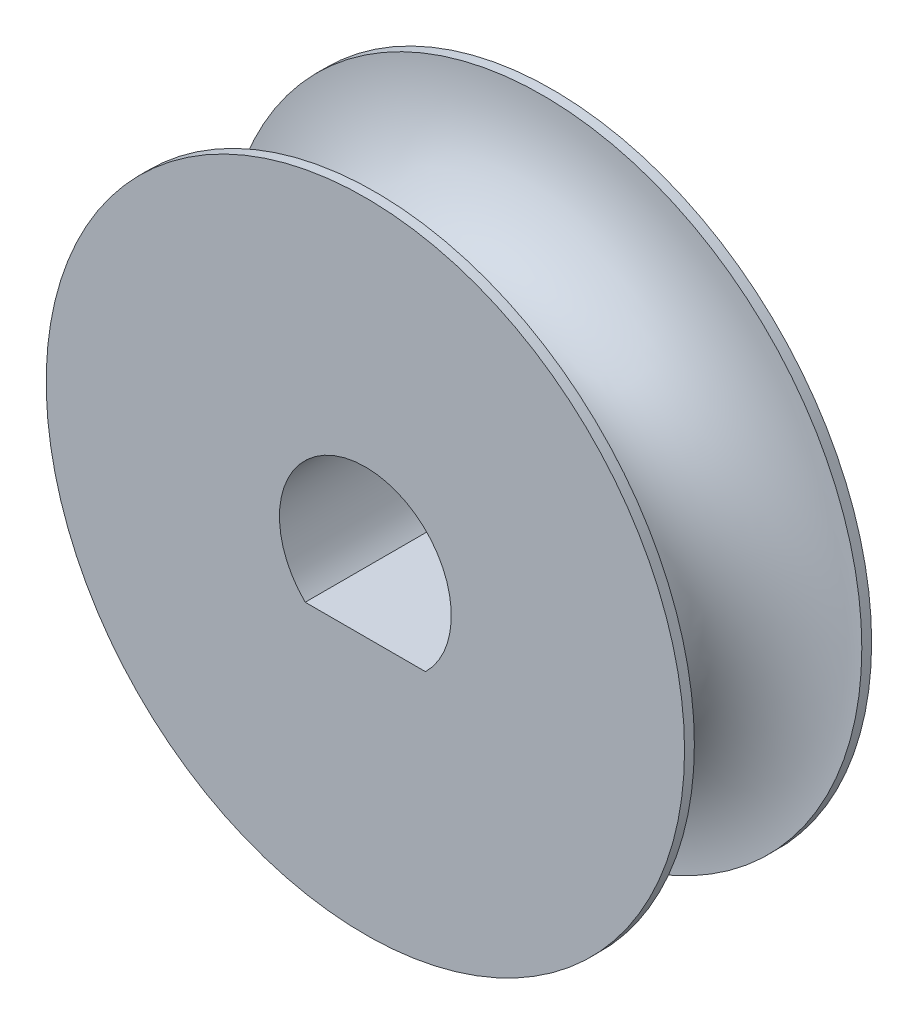
ISO-10303-21;
HEADER;
FILE_DESCRIPTION(('STEP AP214'),'2;1');
FILE_NAME('part.step','',(''),(''),'','','');
FILE_SCHEMA(('AUTOMOTIVE_DESIGN { 1 0 10303 214 1 1 1 1 }'));
ENDSEC;
DATA;
#1=APPLICATION_CONTEXT('core data for automotive mechanical design processes');
#2=APPLICATION_PROTOCOL_DEFINITION('international standard','automotive_design',2000,#1);
#3=PRODUCT_CONTEXT('',#1,'mechanical');
#4=PRODUCT('Part','Part','',(#3));
#5=PRODUCT_RELATED_PRODUCT_CATEGORY('part','',(#4));
#6=PRODUCT_DEFINITION_FORMATION('','',#4);
#7=PRODUCT_DEFINITION_CONTEXT('part definition',#1,'design');
#8=PRODUCT_DEFINITION('design','',#6,#7);
#9=PRODUCT_DEFINITION_SHAPE('','',#8);
#10=(LENGTH_UNIT() NAMED_UNIT(*) SI_UNIT(.MILLI.,.METRE.));
#11=(NAMED_UNIT(*) PLANE_ANGLE_UNIT() SI_UNIT($,.RADIAN.));
#12=(NAMED_UNIT(*) SI_UNIT($,.STERADIAN.) SOLID_ANGLE_UNIT());
#13=UNCERTAINTY_MEASURE_WITH_UNIT(LENGTH_MEASURE(1.E-05),#10,'distance_accuracy_value','');
#14=(GEOMETRIC_REPRESENTATION_CONTEXT(3) GLOBAL_UNCERTAINTY_ASSIGNED_CONTEXT((#13)) GLOBAL_UNIT_ASSIGNED_CONTEXT((#10,
#11,#12)) REPRESENTATION_CONTEXT('',''));
#15=CARTESIAN_POINT('',(0.,0.,0.));
#16=DIRECTION('',(0.,0.,1.));
#17=DIRECTION('',(1.,0.,0.));
#18=AXIS2_PLACEMENT_3D('',#15,#16,#17);
#19=CARTESIAN_POINT('',(-25.2757738629294,2.90747906476861,-5.81));
#20=DIRECTION('',(0.,0.,1.));
#21=DIRECTION('',(1.,0.,0.));
#22=AXIS2_PLACEMENT_3D('',#19,#20,#21);
#23=CYLINDRICAL_SURFACE('',#22,6.5);
#24=CARTESIAN_POINT('',(-25.2757738629294,2.90747906476861,-5.61));
#25=DIRECTION('',(0.,0.,1.));
#26=DIRECTION('',(1.,0.,0.));
#27=AXIS2_PLACEMENT_3D('',#24,#25,#26);
#28=CIRCLE('',#27,6.5);
#29=CARTESIAN_POINT('',(-18.7757738629294,2.90747906476861,-5.61));
#30=VERTEX_POINT('',#29);
#31=EDGE_CURVE('E39',#30,#30,#28,.T.);
#32=ORIENTED_EDGE('',*,*,#31,.F.);
#33=EDGE_LOOP('',(#32));
#34=FACE_BOUND('',#33,.T.);
#35=CARTESIAN_POINT('',(-25.2757738629294,2.90747906476861,-5.81));
#36=DIRECTION('',(0.,0.,1.));
#37=DIRECTION('',(1.,0.,0.));
#38=AXIS2_PLACEMENT_3D('',#35,#36,#37);
#39=CIRCLE('',#38,6.5);
#40=CARTESIAN_POINT('',(-18.7757738629294,2.90747906476861,-5.81));
#41=VERTEX_POINT('',#40);
#42=EDGE_CURVE('E80',#41,#41,#39,.T.);
#43=ORIENTED_EDGE('',*,*,#42,.T.);
#44=EDGE_LOOP('',(#43));
#45=FACE_BOUND('',#44,.T.);
#46=ADVANCED_FACE('F35',(#34,#45),#23,.T.);
#47=CARTESIAN_POINT('',(-25.2757738629294,2.90747906476861,-5.81));
#48=DIRECTION('',(0.,0.,1.));
#49=DIRECTION('',(1.,0.,0.));
#50=AXIS2_PLACEMENT_3D('',#47,#48,#49);
#51=CYLINDRICAL_SURFACE('',#50,1.75);
#52=CARTESIAN_POINT('',(-25.2757738629294,2.90747906476861,-2.));
#53=DIRECTION('',(0.,0.,1.));
#54=DIRECTION('',(1.,0.,0.));
#55=AXIS2_PLACEMENT_3D('',#52,#53,#54);
#56=CIRCLE('',#55,1.75);
#57=CARTESIAN_POINT('',(-24.0510289915378,1.65747906476861,-2.));
#58=VERTEX_POINT('',#57);
#59=CARTESIAN_POINT('',(-26.500518734321,1.65747906476861,-2.));
#60=VERTEX_POINT('',#59);
#61=EDGE_CURVE('E69',#58,#60,#56,.T.);
#62=ORIENTED_EDGE('',*,*,#61,.T.);
#63=DIRECTION('',(0.,0.,1.));
#64=VECTOR('',#63,1.);
#65=CARTESIAN_POINT('',(-26.500518734321,1.65747906476861,-5.81));
#66=LINE('',#65,#64);
#67=CARTESIAN_POINT('',(-26.500518734321,1.65747906476861,-5.81));
#68=VERTEX_POINT('',#67);
#69=EDGE_CURVE('E11',#68,#60,#66,.T.);
#70=ORIENTED_EDGE('',*,*,#69,.F.);
#71=CARTESIAN_POINT('',(-25.2757738629294,2.90747906476861,-5.81));
#72=DIRECTION('',(0.,0.,1.));
#73=DIRECTION('',(1.,0.,0.));
#74=AXIS2_PLACEMENT_3D('',#71,#72,#73);
#75=CIRCLE('',#74,1.75);
#76=CARTESIAN_POINT('',(-24.0510289915378,1.65747906476861,-5.81));
#77=VERTEX_POINT('',#76);
#78=EDGE_CURVE('E53',#77,#68,#75,.T.);
#79=ORIENTED_EDGE('',*,*,#78,.F.);
#80=DIRECTION('',(0.,0.,1.));
#81=VECTOR('',#80,1.);
#82=CARTESIAN_POINT('',(-24.0510289915378,1.65747906476861,-5.81));
#83=LINE('',#82,#81);
#84=EDGE_CURVE('E45',#77,#58,#83,.T.);
#85=ORIENTED_EDGE('',*,*,#84,.T.);
#86=EDGE_LOOP('',(#62,#70,#79,#85));
#87=FACE_BOUND('',#86,.T.);
#88=ADVANCED_FACE('F37',(#87),#51,.F.);
#89=CARTESIAN_POINT('',(0.,1.65747906476861,-5.81));
#90=DIRECTION('',(0.,1.,0.));
#91=DIRECTION('',(-1.,0.,0.));
#92=AXIS2_PLACEMENT_3D('',#89,#90,#91);
#93=PLANE('',#92);
#94=DIRECTION('',(-1.,0.,0.));
#95=VECTOR('',#94,1.);
#96=CARTESIAN_POINT('',(0.,1.65747906476861,-2.));
#97=LINE('',#96,#95);
#98=EDGE_CURVE('E67',#58,#60,#97,.T.);
#99=ORIENTED_EDGE('',*,*,#98,.F.);
#100=ORIENTED_EDGE('',*,*,#84,.F.);
#101=DIRECTION('',(-1.,0.,0.));
#102=VECTOR('',#101,1.);
#103=CARTESIAN_POINT('',(0.,1.65747906476861,-5.81));
#104=LINE('',#103,#102);
#105=EDGE_CURVE('E68',#77,#68,#104,.T.);
#106=ORIENTED_EDGE('',*,*,#105,.T.);
#107=ORIENTED_EDGE('',*,*,#69,.T.);
#108=EDGE_LOOP('',(#99,#100,#106,#107));
#109=FACE_BOUND('',#108,.T.);
#110=ADVANCED_FACE('F65',(#109),#93,.T.);
#111=CARTESIAN_POINT('',(-25.2757738629294,2.90747906476861,-2.2));
#112=DIRECTION('',(0.,0.,1.));
#113=DIRECTION('',(1.,0.,0.));
#114=AXIS2_PLACEMENT_3D('',#111,#112,#113);
#115=CIRCLE('',#114,6.5);
#116=CARTESIAN_POINT('',(-18.7757738629294,2.90747906476861,-2.2));
#117=VERTEX_POINT('',#116);
#118=EDGE_CURVE('E81',#117,#117,#115,.F.);
#119=ORIENTED_EDGE('',*,*,#118,.F.);
#120=EDGE_LOOP('',(#119));
#121=FACE_BOUND('',#120,.T.);
#122=CARTESIAN_POINT('',(-25.2757738629294,2.90747906476861,-2.));
#123=DIRECTION('',(0.,0.,1.));
#124=DIRECTION('',(1.,0.,0.));
#125=AXIS2_PLACEMENT_3D('',#122,#123,#124);
#126=CIRCLE('',#125,6.5);
#127=CARTESIAN_POINT('',(-18.7757738629294,2.90747906476861,-2.));
#128=VERTEX_POINT('',#127);
#129=EDGE_CURVE('E74',#128,#128,#126,.T.);
#130=ORIENTED_EDGE('',*,*,#129,.F.);
#131=EDGE_LOOP('',(#130));
#132=FACE_BOUND('',#131,.T.);
#133=ADVANCED_FACE('F93',(#121,#132),#23,.T.);
#134=CARTESIAN_POINT('',(0.,0.,-5.81));
#135=DIRECTION('',(0.,0.,1.));
#136=DIRECTION('',(1.,0.,0.));
#137=AXIS2_PLACEMENT_3D('',#134,#135,#136);
#138=PLANE('',#137);
#139=ORIENTED_EDGE('',*,*,#78,.T.);
#140=ORIENTED_EDGE('',*,*,#105,.F.);
#141=EDGE_LOOP('',(#139,#140));
#142=FACE_BOUND('',#141,.T.);
#143=ORIENTED_EDGE('',*,*,#42,.F.);
#144=EDGE_LOOP('',(#143));
#145=FACE_BOUND('',#144,.T.);
#146=ADVANCED_FACE('F104',(#142,#145),#138,.F.);
#147=CARTESIAN_POINT('',(0.,0.,-2.));
#148=DIRECTION('',(0.,0.,1.));
#149=DIRECTION('',(1.,0.,0.));
#150=AXIS2_PLACEMENT_3D('',#147,#148,#149);
#151=PLANE('',#150);
#152=ORIENTED_EDGE('',*,*,#61,.F.);
#153=ORIENTED_EDGE('',*,*,#98,.T.);
#154=EDGE_LOOP('',(#152,#153));
#155=FACE_BOUND('',#154,.T.);
#156=ORIENTED_EDGE('',*,*,#129,.T.);
#157=EDGE_LOOP('',(#156));
#158=FACE_BOUND('',#157,.T.);
#159=ADVANCED_FACE('F72',(#155,#158),#151,.T.);
#160=CARTESIAN_POINT('',(-18.9092139746438,1.59716796091856,-3.905));
#161=DIRECTION('',(0.201586323669239,0.97947075204394,0.));
#162=DIRECTION('',(0.97947075204394,-0.201586323669239,0.));
#163=AXIS2_PLACEMENT_3D('',#160,#161,#162);
#164=ELLIPSE('',#163,2.5,1.705);
#165=CARTESIAN_POINT('',(-25.2757738629294,2.90747906476861,0.77314421264419));
#166=DIRECTION('',(0.,0.,1.));
#167=AXIS1_PLACEMENT('',#165,#166);
#168=SURFACE_OF_REVOLUTION('',#164,#167);
#169=ORIENTED_EDGE('',*,*,#31,.T.);
#170=EDGE_LOOP('',(#169));
#171=FACE_BOUND('',#170,.T.);
#172=ORIENTED_EDGE('',*,*,#118,.T.);
#173=EDGE_LOOP('',(#172));
#174=FACE_BOUND('',#173,.T.);
#175=ADVANCED_FACE('F88',(#171,#174),#168,.T.);
#176=CLOSED_SHELL('',(#46,#88,#110,#133,#146,#159,#175));
#177=MANIFOLD_SOLID_BREP('B2',#176);
#178=ADVANCED_BREP_SHAPE_REPRESENTATION('',(#18,#177),#14);
#179=SHAPE_DEFINITION_REPRESENTATION(#9,#178);
ENDSEC;
END-ISO-10303-21;
